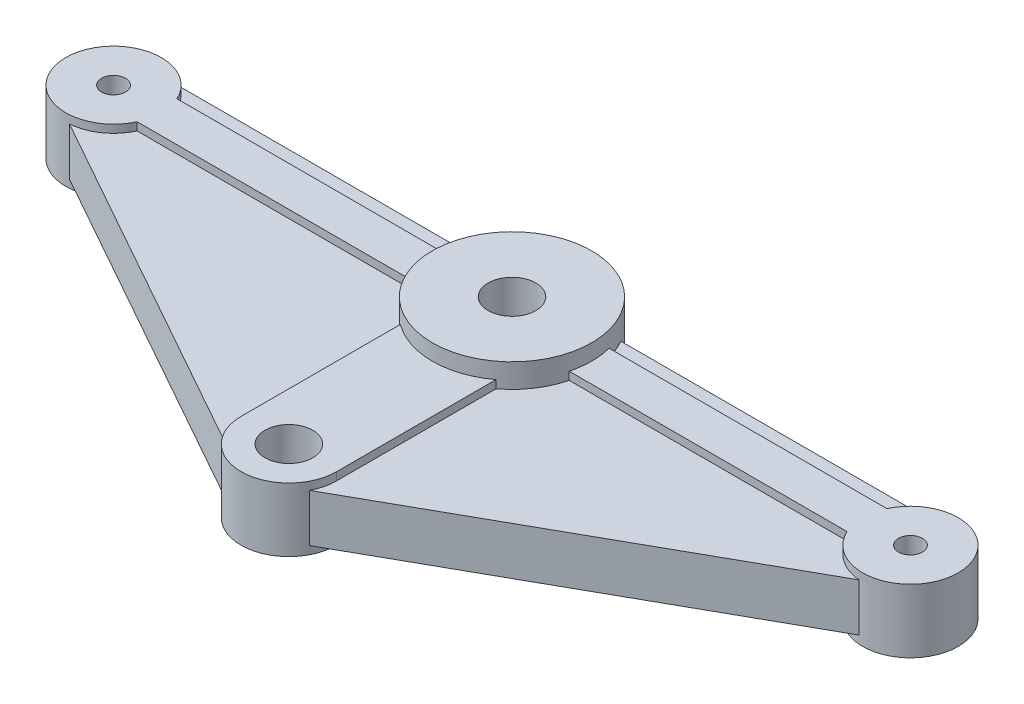
ISO-10303-21;
HEADER;
FILE_DESCRIPTION(('STEP AP214'),'2;1');
FILE_NAME('part.step','',(''),(''),'','','');
FILE_SCHEMA(('AUTOMOTIVE_DESIGN { 1 0 10303 214 1 1 1 1 }'));
ENDSEC;
DATA;
#1=APPLICATION_CONTEXT('core data for automotive mechanical design processes');
#2=APPLICATION_PROTOCOL_DEFINITION('international standard','automotive_design',2000,#1);
#3=PRODUCT_CONTEXT('',#1,'mechanical');
#4=PRODUCT('Part','Part','',(#3));
#5=PRODUCT_RELATED_PRODUCT_CATEGORY('part','',(#4));
#6=PRODUCT_DEFINITION_FORMATION('','',#4);
#7=PRODUCT_DEFINITION_CONTEXT('part definition',#1,'design');
#8=PRODUCT_DEFINITION('design','',#6,#7);
#9=PRODUCT_DEFINITION_SHAPE('','',#8);
#10=(LENGTH_UNIT() NAMED_UNIT(*) SI_UNIT(.MILLI.,.METRE.));
#11=(NAMED_UNIT(*) PLANE_ANGLE_UNIT() SI_UNIT($,.RADIAN.));
#12=(NAMED_UNIT(*) SI_UNIT($,.STERADIAN.) SOLID_ANGLE_UNIT());
#13=UNCERTAINTY_MEASURE_WITH_UNIT(LENGTH_MEASURE(1.E-05),#10,'distance_accuracy_value','');
#14=(GEOMETRIC_REPRESENTATION_CONTEXT(3) GLOBAL_UNCERTAINTY_ASSIGNED_CONTEXT((#13)) GLOBAL_UNIT_ASSIGNED_CONTEXT((#10,
#11,#12)) REPRESENTATION_CONTEXT('',''));
#15=CARTESIAN_POINT('',(0.,0.,0.));
#16=DIRECTION('',(0.,0.,1.));
#17=DIRECTION('',(1.,0.,0.));
#18=AXIS2_PLACEMENT_3D('',#15,#16,#17);
#19=CARTESIAN_POINT('',(-25.,1.5,0.));
#20=DIRECTION('',(0.,1.,0.));
#21=DIRECTION('',(0.,0.,1.));
#22=AXIS2_PLACEMENT_3D('',#19,#20,#21);
#23=PLANE('',#22);
#24=DIRECTION('',(1.,0.,0.));
#25=VECTOR('',#24,1.);
#26=CARTESIAN_POINT('',(-25.,1.5,-1.25));
#27=LINE('',#26,#25);
#28=CARTESIAN_POINT('',(-22.2728219713411,1.5,-1.25));
#29=VERTEX_POINT('',#28);
#30=CARTESIAN_POINT('',(-4.84122918275927,1.5,-1.25));
#31=VERTEX_POINT('',#30);
#32=EDGE_CURVE('E333',#29,#31,#27,.T.);
#33=ORIENTED_EDGE('',*,*,#32,.T.);
#34=CARTESIAN_POINT('',(0.,1.5,0.));
#35=DIRECTION('',(0.,1.,0.));
#36=DIRECTION('',(0.,0.,1.));
#37=AXIS2_PLACEMENT_3D('',#34,#35,#36);
#38=CIRCLE('',#37,5.);
#39=CARTESIAN_POINT('',(-4.33012701892219,1.5,-2.50000000000001));
#40=VERTEX_POINT('',#39);
#41=EDGE_CURVE('E491',#31,#40,#38,.F.);
#42=ORIENTED_EDGE('',*,*,#41,.T.);
#43=DIRECTION('',(-1.,0.,0.));
#44=VECTOR('',#43,1.);
#45=CARTESIAN_POINT('',(-25.,1.5,-2.50000000000001));
#46=LINE('',#45,#44);
#47=CARTESIAN_POINT('',(-23.3416876048223,1.5,-2.50000000000001));
#48=VERTEX_POINT('',#47);
#49=EDGE_CURVE('E274',#40,#48,#46,.T.);
#50=ORIENTED_EDGE('',*,*,#49,.T.);
#51=CARTESIAN_POINT('',(-25.,1.5,0.));
#52=DIRECTION('',(0.,1.,0.));
#53=DIRECTION('',(0.,0.,1.));
#54=AXIS2_PLACEMENT_3D('',#51,#52,#53);
#55=CIRCLE('',#54,3.);
#56=EDGE_CURVE('E352',#48,#29,#55,.F.);
#57=ORIENTED_EDGE('',*,*,#56,.T.);
#58=EDGE_LOOP('',(#33,#42,#50,#57));
#59=FACE_BOUND('',#58,.T.);
#60=ADVANCED_FACE('F30',(#59),#23,.T.);
#61=CARTESIAN_POINT('',(23.3416876048223,1.5,-2.50000000000001));
#62=VERTEX_POINT('',#61);
#63=CARTESIAN_POINT('',(4.33012701892219,1.5,-2.50000000000001));
#64=VERTEX_POINT('',#63);
#65=EDGE_CURVE('E275',#62,#64,#46,.T.);
#66=ORIENTED_EDGE('',*,*,#65,.T.);
#67=CARTESIAN_POINT('',(4.84122918275927,1.5,-1.25));
#68=VERTEX_POINT('',#67);
#69=EDGE_CURVE('E477',#64,#68,#38,.F.);
#70=ORIENTED_EDGE('',*,*,#69,.T.);
#71=DIRECTION('',(1.,0.,0.));
#72=VECTOR('',#71,1.);
#73=CARTESIAN_POINT('',(-25.,1.5,-1.25));
#74=LINE('',#73,#72);
#75=CARTESIAN_POINT('',(22.2728219713411,1.5,-1.25));
#76=VERTEX_POINT('',#75);
#77=EDGE_CURVE('E338',#68,#76,#74,.T.);
#78=ORIENTED_EDGE('',*,*,#77,.T.);
#79=CARTESIAN_POINT('',(25.,1.5,0.));
#80=DIRECTION('',(0.,1.,0.));
#81=DIRECTION('',(0.,0.,1.));
#82=AXIS2_PLACEMENT_3D('',#79,#80,#81);
#83=CIRCLE('',#82,3.);
#84=EDGE_CURVE('E343',#76,#62,#83,.F.);
#85=ORIENTED_EDGE('',*,*,#84,.T.);
#86=EDGE_LOOP('',(#66,#70,#78,#85));
#87=FACE_BOUND('',#86,.T.);
#88=ADVANCED_FACE('F529',(#87),#23,.T.);
#89=CARTESIAN_POINT('',(-25.,-1.5,0.));
#90=DIRECTION('',(0.,1.,0.));
#91=DIRECTION('',(0.,0.,1.));
#92=AXIS2_PLACEMENT_3D('',#89,#90,#91);
#93=PLANE('',#92);
#94=CARTESIAN_POINT('',(0.,-1.5,0.));
#95=DIRECTION('',(0.,1.,0.));
#96=DIRECTION('',(0.,0.,1.));
#97=AXIS2_PLACEMENT_3D('',#94,#95,#96);
#98=CIRCLE('',#97,5.);
#99=CARTESIAN_POINT('',(-4.84122918275927,-1.5,-1.25));
#100=VERTEX_POINT('',#99);
#101=CARTESIAN_POINT('',(-4.33012701892219,-1.5,-2.50000000000001));
#102=VERTEX_POINT('',#101);
#103=EDGE_CURVE('E482',#100,#102,#98,.F.);
#104=ORIENTED_EDGE('',*,*,#103,.F.);
#105=DIRECTION('',(1.,0.,0.));
#106=VECTOR('',#105,1.);
#107=CARTESIAN_POINT('',(-25.,-1.5,-1.25));
#108=LINE('',#107,#106);
#109=CARTESIAN_POINT('',(-22.2728219713411,-1.5,-1.25));
#110=VERTEX_POINT('',#109);
#111=EDGE_CURVE('E326',#110,#100,#108,.T.);
#112=ORIENTED_EDGE('',*,*,#111,.F.);
#113=CARTESIAN_POINT('',(-25.,-1.5,0.));
#114=DIRECTION('',(0.,1.,0.));
#115=DIRECTION('',(0.,0.,1.));
#116=AXIS2_PLACEMENT_3D('',#113,#114,#115);
#117=CIRCLE('',#116,3.);
#118=CARTESIAN_POINT('',(-23.3416876048223,-1.5,-2.50000000000001));
#119=VERTEX_POINT('',#118);
#120=EDGE_CURVE('E316',#119,#110,#117,.F.);
#121=ORIENTED_EDGE('',*,*,#120,.F.);
#122=DIRECTION('',(-1.,0.,0.));
#123=VECTOR('',#122,1.);
#124=CARTESIAN_POINT('',(-25.,-1.5,-2.50000000000001));
#125=LINE('',#124,#123);
#126=EDGE_CURVE('E265',#102,#119,#125,.T.);
#127=ORIENTED_EDGE('',*,*,#126,.F.);
#128=EDGE_LOOP('',(#104,#112,#121,#127));
#129=FACE_BOUND('',#128,.T.);
#130=ADVANCED_FACE('F535',(#129),#93,.F.);
#131=CARTESIAN_POINT('',(4.33012701892219,-1.5,-2.50000000000001));
#132=VERTEX_POINT('',#131);
#133=CARTESIAN_POINT('',(4.84122918275927,-1.5,-1.25));
#134=VERTEX_POINT('',#133);
#135=EDGE_CURVE('E471',#132,#134,#98,.F.);
#136=ORIENTED_EDGE('',*,*,#135,.F.);
#137=CARTESIAN_POINT('',(23.3416876048223,-1.5,-2.50000000000001));
#138=VERTEX_POINT('',#137);
#139=EDGE_CURVE('E266',#138,#132,#125,.T.);
#140=ORIENTED_EDGE('',*,*,#139,.F.);
#141=CARTESIAN_POINT('',(25.,-1.5,0.));
#142=DIRECTION('',(0.,1.,0.));
#143=DIRECTION('',(0.,0.,1.));
#144=AXIS2_PLACEMENT_3D('',#141,#142,#143);
#145=CIRCLE('',#144,3.);
#146=CARTESIAN_POINT('',(22.2728219713411,-1.5,-1.25));
#147=VERTEX_POINT('',#146);
#148=EDGE_CURVE('E340',#147,#138,#145,.F.);
#149=ORIENTED_EDGE('',*,*,#148,.F.);
#150=DIRECTION('',(1.,0.,0.));
#151=VECTOR('',#150,1.);
#152=CARTESIAN_POINT('',(-25.,-1.5,-1.25));
#153=LINE('',#152,#151);
#154=EDGE_CURVE('E336',#134,#147,#153,.T.);
#155=ORIENTED_EDGE('',*,*,#154,.F.);
#156=EDGE_LOOP('',(#136,#140,#149,#155));
#157=FACE_BOUND('',#156,.T.);
#158=ADVANCED_FACE('F552',(#157),#93,.F.);
#159=CARTESIAN_POINT('',(-25.,1.5,-2.50000000000001));
#160=DIRECTION('',(0.,0.,1.));
#161=DIRECTION('',(1.,0.,0.));
#162=AXIS2_PLACEMENT_3D('',#159,#160,#161);
#163=PLANE('',#162);
#164=DIRECTION('',(0.,-1.,0.));
#165=VECTOR('',#164,1.);
#166=CARTESIAN_POINT('',(-4.33012701892219,3.,-2.50000000000001));
#167=LINE('',#166,#165);
#168=EDGE_CURVE('E484',#102,#40,#167,.F.);
#169=ORIENTED_EDGE('',*,*,#168,.F.);
#170=ORIENTED_EDGE('',*,*,#126,.T.);
#171=DIRECTION('',(0.,-1.,0.));
#172=VECTOR('',#171,1.);
#173=CARTESIAN_POINT('',(-23.3416876048223,2.,-2.50000000000001));
#174=LINE('',#173,#172);
#175=EDGE_CURVE('E281',#48,#119,#174,.T.);
#176=ORIENTED_EDGE('',*,*,#175,.F.);
#177=ORIENTED_EDGE('',*,*,#49,.F.);
#178=EDGE_LOOP('',(#169,#170,#176,#177));
#179=FACE_BOUND('',#178,.T.);
#180=ADVANCED_FACE('F563',(#179),#163,.F.);
#181=DIRECTION('',(0.,-1.,0.));
#182=VECTOR('',#181,1.);
#183=CARTESIAN_POINT('',(4.33012701892219,3.,-2.50000000000001));
#184=LINE('',#183,#182);
#185=EDGE_CURVE('E472',#64,#132,#184,.T.);
#186=ORIENTED_EDGE('',*,*,#185,.F.);
#187=ORIENTED_EDGE('',*,*,#65,.F.);
#188=DIRECTION('',(0.,-1.,0.));
#189=VECTOR('',#188,1.);
#190=CARTESIAN_POINT('',(23.3416876048223,2.,-2.50000000000001));
#191=LINE('',#190,#189);
#192=EDGE_CURVE('E278',#138,#62,#191,.F.);
#193=ORIENTED_EDGE('',*,*,#192,.F.);
#194=ORIENTED_EDGE('',*,*,#139,.T.);
#195=EDGE_LOOP('',(#186,#187,#193,#194));
#196=FACE_BOUND('',#195,.T.);
#197=ADVANCED_FACE('F569',(#196),#163,.F.);
#198=CARTESIAN_POINT('',(-22.2728219713411,2.,1.25));
#199=DIRECTION('',(0.,0.,-1.));
#200=DIRECTION('',(-1.,0.,0.));
#201=AXIS2_PLACEMENT_3D('',#198,#199,#200);
#202=PLANE('',#201);
#203=DIRECTION('',(0.,-1.,0.));
#204=VECTOR('',#203,1.);
#205=CARTESIAN_POINT('',(-4.84122918275927,3.,1.25));
#206=LINE('',#205,#204);
#207=CARTESIAN_POINT('',(-4.84122918275927,-1.5,1.25));
#208=VERTEX_POINT('',#207);
#209=CARTESIAN_POINT('',(-4.84122918275927,-2.,1.25));
#210=VERTEX_POINT('',#209);
#211=EDGE_CURVE('E303',#208,#210,#206,.T.);
#212=ORIENTED_EDGE('',*,*,#211,.F.);
#213=DIRECTION('',(-1.,0.,0.));
#214=VECTOR('',#213,1.);
#215=CARTESIAN_POINT('',(-25.,-1.5,1.25));
#216=LINE('',#215,#214);
#217=CARTESIAN_POINT('',(-22.2728219713411,-1.5,1.25));
#218=VERTEX_POINT('',#217);
#219=EDGE_CURVE('E38',#208,#218,#216,.T.);
#220=ORIENTED_EDGE('',*,*,#219,.T.);
#221=DIRECTION('',(0.,-1.,0.));
#222=VECTOR('',#221,1.);
#223=CARTESIAN_POINT('',(-22.2728219713411,2.,1.25));
#224=LINE('',#223,#222);
#225=CARTESIAN_POINT('',(-22.2728219713411,-2.,1.25));
#226=VERTEX_POINT('',#225);
#227=EDGE_CURVE('E301',#218,#226,#224,.T.);
#228=ORIENTED_EDGE('',*,*,#227,.T.);
#229=DIRECTION('',(1.,0.,0.));
#230=VECTOR('',#229,1.);
#231=CARTESIAN_POINT('',(-22.2728219713411,-2.,1.25));
#232=LINE('',#231,#230);
#233=EDGE_CURVE('E436',#226,#210,#232,.T.);
#234=ORIENTED_EDGE('',*,*,#233,.T.);
#235=EDGE_LOOP('',(#212,#220,#228,#234));
#236=FACE_BOUND('',#235,.T.);
#237=ADVANCED_FACE('F298',(#236),#202,.F.);
#238=CARTESIAN_POINT('',(-3.,2.,1.25));
#239=DIRECTION('',(1.,0.,0.));
#240=DIRECTION('',(0.,0.,-1.));
#241=AXIS2_PLACEMENT_3D('',#238,#239,#240);
#242=PLANE('',#241);
#243=DIRECTION('',(0.,-1.,0.));
#244=VECTOR('',#243,1.);
#245=CARTESIAN_POINT('',(-3.,3.,4.));
#246=LINE('',#245,#244);
#247=CARTESIAN_POINT('',(-3.,-2.,4.));
#248=VERTEX_POINT('',#247);
#249=CARTESIAN_POINT('',(-3.,-1.5,4.));
#250=VERTEX_POINT('',#249);
#251=EDGE_CURVE('E464',#248,#250,#246,.F.);
#252=ORIENTED_EDGE('',*,*,#251,.F.);
#253=DIRECTION('',(0.,0.,1.));
#254=VECTOR('',#253,1.);
#255=CARTESIAN_POINT('',(-3.,-2.,1.25));
#256=LINE('',#255,#254);
#257=CARTESIAN_POINT('',(-3.,-2.,14.));
#258=VERTEX_POINT('',#257);
#259=EDGE_CURVE('E378',#248,#258,#256,.T.);
#260=ORIENTED_EDGE('',*,*,#259,.T.);
#261=DIRECTION('',(0.,-1.,0.));
#262=VECTOR('',#261,1.);
#263=CARTESIAN_POINT('',(-3.,2.,14.));
#264=LINE('',#263,#262);
#265=CARTESIAN_POINT('',(-3.,-1.5,14.));
#266=VERTEX_POINT('',#265);
#267=EDGE_CURVE('E327',#266,#258,#264,.T.);
#268=ORIENTED_EDGE('',*,*,#267,.F.);
#269=DIRECTION('',(0.,0.,-1.));
#270=VECTOR('',#269,1.);
#271=CARTESIAN_POINT('',(-3.,-1.5,0.));
#272=LINE('',#271,#270);
#273=EDGE_CURVE('E292',#266,#250,#272,.T.);
#274=ORIENTED_EDGE('',*,*,#273,.T.);
#275=EDGE_LOOP('',(#252,#260,#268,#274));
#276=FACE_BOUND('',#275,.T.);
#277=ADVANCED_FACE('F376',(#276),#242,.F.);
#278=CARTESIAN_POINT('',(3.,2.,1.25));
#279=DIRECTION('',(-1.,0.,0.));
#280=DIRECTION('',(0.,0.,1.));
#281=AXIS2_PLACEMENT_3D('',#278,#279,#280);
#282=PLANE('',#281);
#283=DIRECTION('',(0.,-1.,0.));
#284=VECTOR('',#283,1.);
#285=CARTESIAN_POINT('',(3.,3.,4.));
#286=LINE('',#285,#284);
#287=CARTESIAN_POINT('',(3.,-1.5,4.));
#288=VERTEX_POINT('',#287);
#289=CARTESIAN_POINT('',(3.,-2.,4.));
#290=VERTEX_POINT('',#289);
#291=EDGE_CURVE('E459',#288,#290,#286,.T.);
#292=ORIENTED_EDGE('',*,*,#291,.F.);
#293=DIRECTION('',(0.,0.,1.));
#294=VECTOR('',#293,1.);
#295=CARTESIAN_POINT('',(3.,-1.5,0.));
#296=LINE('',#295,#294);
#297=CARTESIAN_POINT('',(3.,-1.5,14.));
#298=VERTEX_POINT('',#297);
#299=EDGE_CURVE('E290',#288,#298,#296,.T.);
#300=ORIENTED_EDGE('',*,*,#299,.T.);
#301=DIRECTION('',(0.,-1.,0.));
#302=VECTOR('',#301,1.);
#303=CARTESIAN_POINT('',(3.,2.,14.));
#304=LINE('',#303,#302);
#305=CARTESIAN_POINT('',(3.,-2.,14.));
#306=VERTEX_POINT('',#305);
#307=EDGE_CURVE('E381',#298,#306,#304,.T.);
#308=ORIENTED_EDGE('',*,*,#307,.T.);
#309=DIRECTION('',(0.,0.,-1.));
#310=VECTOR('',#309,1.);
#311=CARTESIAN_POINT('',(3.,-2.,1.25));
#312=LINE('',#311,#310);
#313=EDGE_CURVE('E430',#306,#290,#312,.T.);
#314=ORIENTED_EDGE('',*,*,#313,.T.);
#315=EDGE_LOOP('',(#292,#300,#308,#314));
#316=FACE_BOUND('',#315,.T.);
#317=ADVANCED_FACE('F603',(#316),#282,.F.);
#318=CARTESIAN_POINT('',(3.,2.,1.25));
#319=DIRECTION('',(0.,0.,-1.));
#320=DIRECTION('',(-1.,0.,0.));
#321=AXIS2_PLACEMENT_3D('',#318,#319,#320);
#322=PLANE('',#321);
#323=DIRECTION('',(0.,-1.,0.));
#324=VECTOR('',#323,1.);
#325=CARTESIAN_POINT('',(4.84122918275927,3.,1.25));
#326=LINE('',#325,#324);
#327=CARTESIAN_POINT('',(4.84122918275927,-2.,1.25));
#328=VERTEX_POINT('',#327);
#329=CARTESIAN_POINT('',(4.84122918275927,-1.5,1.25));
#330=VERTEX_POINT('',#329);
#331=EDGE_CURVE('E461',#328,#330,#326,.F.);
#332=ORIENTED_EDGE('',*,*,#331,.F.);
#333=DIRECTION('',(1.,0.,0.));
#334=VECTOR('',#333,1.);
#335=CARTESIAN_POINT('',(3.,-2.,1.25));
#336=LINE('',#335,#334);
#337=CARTESIAN_POINT('',(22.2728219713411,-2.,1.25));
#338=VERTEX_POINT('',#337);
#339=EDGE_CURVE('E428',#328,#338,#336,.T.);
#340=ORIENTED_EDGE('',*,*,#339,.T.);
#341=DIRECTION('',(0.,-1.,0.));
#342=VECTOR('',#341,1.);
#343=CARTESIAN_POINT('',(22.2728219713411,2.,1.25));
#344=LINE('',#343,#342);
#345=CARTESIAN_POINT('',(22.2728219713411,-1.5,1.25));
#346=VERTEX_POINT('',#345);
#347=EDGE_CURVE('E390',#346,#338,#344,.T.);
#348=ORIENTED_EDGE('',*,*,#347,.F.);
#349=DIRECTION('',(-1.,0.,0.));
#350=VECTOR('',#349,1.);
#351=CARTESIAN_POINT('',(-25.,-1.5,1.25));
#352=LINE('',#351,#350);
#353=EDGE_CURVE('E287',#346,#330,#352,.T.);
#354=ORIENTED_EDGE('',*,*,#353,.T.);
#355=EDGE_LOOP('',(#332,#340,#348,#354));
#356=FACE_BOUND('',#355,.T.);
#357=ADVANCED_FACE('F666',(#356),#322,.F.);
#358=CARTESIAN_POINT('',(0.829156197588851,2.,-1.25));
#359=DIRECTION('',(0.,0.,1.));
#360=DIRECTION('',(1.,0.,0.));
#361=AXIS2_PLACEMENT_3D('',#358,#359,#360);
#362=PLANE('',#361);
#363=DIRECTION('',(0.,-1.,0.));
#364=VECTOR('',#363,1.);
#365=CARTESIAN_POINT('',(4.84122918275927,3.,-1.25));
#366=LINE('',#365,#364);
#367=CARTESIAN_POINT('',(4.84122918275927,-2.,-1.25));
#368=VERTEX_POINT('',#367);
#369=EDGE_CURVE('E467',#134,#368,#366,.T.);
#370=ORIENTED_EDGE('',*,*,#369,.F.);
#371=ORIENTED_EDGE('',*,*,#154,.T.);
#372=DIRECTION('',(0.,-1.,0.));
#373=VECTOR('',#372,1.);
#374=CARTESIAN_POINT('',(22.2728219713411,2.,-1.25));
#375=LINE('',#374,#373);
#376=CARTESIAN_POINT('',(22.2728219713411,-2.,-1.25));
#377=VERTEX_POINT('',#376);
#378=EDGE_CURVE('E394',#147,#377,#375,.T.);
#379=ORIENTED_EDGE('',*,*,#378,.T.);
#380=DIRECTION('',(-1.,0.,0.));
#381=VECTOR('',#380,1.);
#382=CARTESIAN_POINT('',(0.829156197588851,-2.,-1.25));
#383=LINE('',#382,#381);
#384=EDGE_CURVE('E422',#377,#368,#383,.T.);
#385=ORIENTED_EDGE('',*,*,#384,.T.);
#386=EDGE_LOOP('',(#370,#371,#379,#385));
#387=FACE_BOUND('',#386,.T.);
#388=ADVANCED_FACE('F589',(#387),#362,.F.);
#389=CARTESIAN_POINT('',(-22.2728219713411,2.,-1.25));
#390=DIRECTION('',(0.,0.,1.));
#391=DIRECTION('',(1.,0.,0.));
#392=AXIS2_PLACEMENT_3D('',#389,#390,#391);
#393=PLANE('',#392);
#394=DIRECTION('',(0.,-1.,0.));
#395=VECTOR('',#394,1.);
#396=CARTESIAN_POINT('',(-4.84122918275927,3.,-1.25));
#397=LINE('',#396,#395);
#398=CARTESIAN_POINT('',(-4.84122918275927,-2.,-1.25));
#399=VERTEX_POINT('',#398);
#400=EDGE_CURVE('E478',#399,#100,#397,.F.);
#401=ORIENTED_EDGE('',*,*,#400,.F.);
#402=DIRECTION('',(-1.,0.,0.));
#403=VECTOR('',#402,1.);
#404=CARTESIAN_POINT('',(-22.2728219713411,-2.,-1.25));
#405=LINE('',#404,#403);
#406=CARTESIAN_POINT('',(-22.2728219713411,-2.,-1.25));
#407=VERTEX_POINT('',#406);
#408=EDGE_CURVE('E420',#399,#407,#405,.T.);
#409=ORIENTED_EDGE('',*,*,#408,.T.);
#410=DIRECTION('',(0.,-1.,0.));
#411=VECTOR('',#410,1.);
#412=CARTESIAN_POINT('',(-22.2728219713411,2.,-1.25));
#413=LINE('',#412,#411);
#414=EDGE_CURVE('E398',#110,#407,#413,.T.);
#415=ORIENTED_EDGE('',*,*,#414,.F.);
#416=ORIENTED_EDGE('',*,*,#111,.T.);
#417=EDGE_LOOP('',(#401,#409,#415,#416));
#418=FACE_BOUND('',#417,.T.);
#419=ADVANCED_FACE('F559',(#418),#393,.F.);
#420=CARTESIAN_POINT('',(-25.,2.,0.));
#421=DIRECTION('',(0.,1.,0.));
#422=DIRECTION('',(0.,0.,1.));
#423=AXIS2_PLACEMENT_3D('',#420,#421,#422);
#424=PLANE('',#423);
#425=CARTESIAN_POINT('',(-25.,2.,0.));
#426=DIRECTION('',(0.,1.,0.));
#427=DIRECTION('',(0.,0.,1.));
#428=AXIS2_PLACEMENT_3D('',#425,#426,#427);
#429=CIRCLE('',#428,0.750000000000002);
#430=CARTESIAN_POINT('',(-25.,2.,0.750000000000002));
#431=VERTEX_POINT('',#430);
#432=EDGE_CURVE('E451',#431,#431,#429,.T.);
#433=ORIENTED_EDGE('',*,*,#432,.F.);
#434=EDGE_LOOP('',(#433));
#435=FACE_BOUND('',#434,.T.);
#436=DIRECTION('',(1.,0.,0.));
#437=VECTOR('',#436,1.);
#438=CARTESIAN_POINT('',(-22.2728219713411,2.,1.25));
#439=LINE('',#438,#437);
#440=CARTESIAN_POINT('',(-22.2728219713411,2.,1.25));
#441=VERTEX_POINT('',#440);
#442=CARTESIAN_POINT('',(-4.84122918275927,2.,1.25));
#443=VERTEX_POINT('',#442);
#444=EDGE_CURVE('E414',#441,#443,#439,.T.);
#445=ORIENTED_EDGE('',*,*,#444,.T.);
#446=CARTESIAN_POINT('',(0.,2.,0.));
#447=DIRECTION('',(0.,1.,0.));
#448=DIRECTION('',(0.,0.,1.));
#449=AXIS2_PLACEMENT_3D('',#446,#447,#448);
#450=CIRCLE('',#449,5.);
#451=CARTESIAN_POINT('',(-4.84122918275927,2.,-1.25));
#452=VERTEX_POINT('',#451);
#453=EDGE_CURVE('E498',#443,#452,#450,.F.);
#454=ORIENTED_EDGE('',*,*,#453,.T.);
#455=DIRECTION('',(-1.,0.,0.));
#456=VECTOR('',#455,1.);
#457=CARTESIAN_POINT('',(-22.2728219713411,2.,-1.25));
#458=LINE('',#457,#456);
#459=CARTESIAN_POINT('',(-22.2728219713411,2.,-1.25));
#460=VERTEX_POINT('',#459);
#461=EDGE_CURVE('E399',#452,#460,#458,.T.);
#462=ORIENTED_EDGE('',*,*,#461,.T.);
#463=CARTESIAN_POINT('',(-25.,2.,0.));
#464=DIRECTION('',(0.,1.,0.));
#465=DIRECTION('',(0.,0.,1.));
#466=AXIS2_PLACEMENT_3D('',#463,#464,#465);
#467=CIRCLE('',#466,3.);
#468=EDGE_CURVE('E417',#460,#441,#467,.T.);
#469=ORIENTED_EDGE('',*,*,#468,.T.);
#470=EDGE_LOOP('',(#445,#454,#462,#469));
#471=FACE_BOUND('',#470,.T.);
#472=ADVANCED_FACE('F622',(#435,#471),#424,.T.);
#473=CARTESIAN_POINT('',(25.,2.,0.));
#474=DIRECTION('',(0.,1.,0.));
#475=DIRECTION('',(0.,0.,1.));
#476=AXIS2_PLACEMENT_3D('',#473,#474,#475);
#477=CIRCLE('',#476,0.750000000000002);
#478=CARTESIAN_POINT('',(25.,2.,0.749999999999996));
#479=VERTEX_POINT('',#478);
#480=EDGE_CURVE('E439',#479,#479,#477,.T.);
#481=ORIENTED_EDGE('',*,*,#480,.F.);
#482=EDGE_LOOP('',(#481));
#483=FACE_BOUND('',#482,.T.);
#484=DIRECTION('',(-1.,0.,0.));
#485=VECTOR('',#484,1.);
#486=CARTESIAN_POINT('',(0.829156197588851,2.,-1.25));
#487=LINE('',#486,#485);
#488=CARTESIAN_POINT('',(22.2728219713411,2.,-1.25));
#489=VERTEX_POINT('',#488);
#490=CARTESIAN_POINT('',(4.84122918275927,2.,-1.25));
#491=VERTEX_POINT('',#490);
#492=EDGE_CURVE('E401',#489,#491,#487,.T.);
#493=ORIENTED_EDGE('',*,*,#492,.T.);
#494=CARTESIAN_POINT('',(4.84122918275927,2.,1.25));
#495=VERTEX_POINT('',#494);
#496=EDGE_CURVE('E486',#491,#495,#450,.F.);
#497=ORIENTED_EDGE('',*,*,#496,.T.);
#498=DIRECTION('',(1.,0.,0.));
#499=VECTOR('',#498,1.);
#500=CARTESIAN_POINT('',(3.,2.,1.25));
#501=LINE('',#500,#499);
#502=CARTESIAN_POINT('',(22.2728219713411,2.,1.25));
#503=VERTEX_POINT('',#502);
#504=EDGE_CURVE('E406',#495,#503,#501,.T.);
#505=ORIENTED_EDGE('',*,*,#504,.T.);
#506=CARTESIAN_POINT('',(25.,2.,0.));
#507=DIRECTION('',(0.,1.,0.));
#508=DIRECTION('',(0.,0.,1.));
#509=AXIS2_PLACEMENT_3D('',#506,#507,#508);
#510=CIRCLE('',#509,3.);
#511=EDGE_CURVE('E404',#503,#489,#510,.T.);
#512=ORIENTED_EDGE('',*,*,#511,.T.);
#513=EDGE_LOOP('',(#493,#497,#505,#512));
#514=FACE_BOUND('',#513,.T.);
#515=ADVANCED_FACE('F619',(#483,#514),#424,.T.);
#516=CARTESIAN_POINT('',(0.,2.,14.));
#517=DIRECTION('',(0.,1.,0.));
#518=DIRECTION('',(0.,0.,1.));
#519=AXIS2_PLACEMENT_3D('',#516,#517,#518);
#520=CIRCLE('',#519,1.5);
#521=CARTESIAN_POINT('',(0.,2.,15.5));
#522=VERTEX_POINT('',#521);
#523=EDGE_CURVE('E445',#522,#522,#520,.T.);
#524=ORIENTED_EDGE('',*,*,#523,.F.);
#525=EDGE_LOOP('',(#524));
#526=FACE_BOUND('',#525,.T.);
#527=DIRECTION('',(0.,0.,-1.));
#528=VECTOR('',#527,1.);
#529=CARTESIAN_POINT('',(3.,2.,1.25));
#530=LINE('',#529,#528);
#531=CARTESIAN_POINT('',(3.,2.,14.));
#532=VERTEX_POINT('',#531);
#533=CARTESIAN_POINT('',(3.,2.,4.));
#534=VERTEX_POINT('',#533);
#535=EDGE_CURVE('E408',#532,#534,#530,.T.);
#536=ORIENTED_EDGE('',*,*,#535,.T.);
#537=CARTESIAN_POINT('',(-3.,2.,4.));
#538=VERTEX_POINT('',#537);
#539=EDGE_CURVE('E499',#534,#538,#450,.F.);
#540=ORIENTED_EDGE('',*,*,#539,.T.);
#541=DIRECTION('',(0.,0.,1.));
#542=VECTOR('',#541,1.);
#543=CARTESIAN_POINT('',(-3.,2.,1.25));
#544=LINE('',#543,#542);
#545=CARTESIAN_POINT('',(-3.,2.,14.));
#546=VERTEX_POINT('',#545);
#547=EDGE_CURVE('E247',#538,#546,#544,.T.);
#548=ORIENTED_EDGE('',*,*,#547,.T.);
#549=CARTESIAN_POINT('',(0.,2.,14.));
#550=DIRECTION('',(0.,1.,0.));
#551=DIRECTION('',(0.,0.,1.));
#552=AXIS2_PLACEMENT_3D('',#549,#550,#551);
#553=CIRCLE('',#552,3.);
#554=EDGE_CURVE('E411',#546,#532,#553,.T.);
#555=ORIENTED_EDGE('',*,*,#554,.T.);
#556=EDGE_LOOP('',(#536,#540,#548,#555));
#557=FACE_BOUND('',#556,.T.);
#558=ADVANCED_FACE('F616',(#526,#557),#424,.T.);
#559=CARTESIAN_POINT('',(-25.,-2.,0.));
#560=DIRECTION('',(0.,1.,0.));
#561=DIRECTION('',(0.,0.,1.));
#562=AXIS2_PLACEMENT_3D('',#559,#560,#561);
#563=PLANE('',#562);
#564=CARTESIAN_POINT('',(-25.,-2.,0.));
#565=DIRECTION('',(0.,1.,0.));
#566=DIRECTION('',(0.,0.,1.));
#567=AXIS2_PLACEMENT_3D('',#564,#565,#566);
#568=CIRCLE('',#567,0.750000000000002);
#569=CARTESIAN_POINT('',(-25.,-2.,0.750000000000002));
#570=VERTEX_POINT('',#569);
#571=EDGE_CURVE('E454',#570,#570,#568,.T.);
#572=ORIENTED_EDGE('',*,*,#571,.T.);
#573=EDGE_LOOP('',(#572));
#574=FACE_BOUND('',#573,.T.);
#575=CARTESIAN_POINT('',(0.,-2.,0.));
#576=DIRECTION('',(0.,1.,0.));
#577=DIRECTION('',(0.,0.,1.));
#578=AXIS2_PLACEMENT_3D('',#575,#576,#577);
#579=CIRCLE('',#578,5.);
#580=EDGE_CURVE('E475',#210,#399,#579,.F.);
#581=ORIENTED_EDGE('',*,*,#580,.F.);
#582=ORIENTED_EDGE('',*,*,#233,.F.);
#583=CARTESIAN_POINT('',(-25.,-2.,0.));
#584=DIRECTION('',(0.,1.,0.));
#585=DIRECTION('',(0.,0.,1.));
#586=AXIS2_PLACEMENT_3D('',#583,#584,#585);
#587=CIRCLE('',#586,3.);
#588=EDGE_CURVE('E321',#407,#226,#587,.T.);
#589=ORIENTED_EDGE('',*,*,#588,.F.);
#590=ORIENTED_EDGE('',*,*,#408,.F.);
#591=EDGE_LOOP('',(#581,#582,#589,#590));
#592=FACE_BOUND('',#591,.T.);
#593=ADVANCED_FACE('F618',(#574,#592),#563,.F.);
#594=CARTESIAN_POINT('',(25.,-2.,0.));
#595=DIRECTION('',(0.,1.,0.));
#596=DIRECTION('',(0.,0.,1.));
#597=AXIS2_PLACEMENT_3D('',#594,#595,#596);
#598=CIRCLE('',#597,0.750000000000002);
#599=CARTESIAN_POINT('',(25.,-2.,0.749999999999996));
#600=VERTEX_POINT('',#599);
#601=EDGE_CURVE('E442',#600,#600,#598,.T.);
#602=ORIENTED_EDGE('',*,*,#601,.T.);
#603=EDGE_LOOP('',(#602));
#604=FACE_BOUND('',#603,.T.);
#605=EDGE_CURVE('E463',#368,#328,#579,.F.);
#606=ORIENTED_EDGE('',*,*,#605,.F.);
#607=ORIENTED_EDGE('',*,*,#384,.F.);
#608=CARTESIAN_POINT('',(25.,-2.,0.));
#609=DIRECTION('',(0.,1.,0.));
#610=DIRECTION('',(0.,0.,1.));
#611=AXIS2_PLACEMENT_3D('',#608,#609,#610);
#612=CIRCLE('',#611,3.);
#613=EDGE_CURVE('E425',#338,#377,#612,.T.);
#614=ORIENTED_EDGE('',*,*,#613,.F.);
#615=ORIENTED_EDGE('',*,*,#339,.F.);
#616=EDGE_LOOP('',(#606,#607,#614,#615));
#617=FACE_BOUND('',#616,.T.);
#618=ADVANCED_FACE('F594',(#604,#617),#563,.F.);
#619=CARTESIAN_POINT('',(0.,-2.,14.));
#620=DIRECTION('',(0.,1.,0.));
#621=DIRECTION('',(0.,0.,1.));
#622=AXIS2_PLACEMENT_3D('',#619,#620,#621);
#623=CIRCLE('',#622,1.5);
#624=CARTESIAN_POINT('',(0.,-2.,15.5));
#625=VERTEX_POINT('',#624);
#626=EDGE_CURVE('E448',#625,#625,#623,.T.);
#627=ORIENTED_EDGE('',*,*,#626,.T.);
#628=EDGE_LOOP('',(#627));
#629=FACE_BOUND('',#628,.T.);
#630=EDGE_CURVE('E466',#290,#248,#579,.F.);
#631=ORIENTED_EDGE('',*,*,#630,.F.);
#632=ORIENTED_EDGE('',*,*,#313,.F.);
#633=CARTESIAN_POINT('',(0.,-2.,14.));
#634=DIRECTION('',(0.,1.,0.));
#635=DIRECTION('',(0.,0.,1.));
#636=AXIS2_PLACEMENT_3D('',#633,#634,#635);
#637=CIRCLE('',#636,3.);
#638=EDGE_CURVE('E433',#258,#306,#637,.T.);
#639=ORIENTED_EDGE('',*,*,#638,.F.);
#640=ORIENTED_EDGE('',*,*,#259,.F.);
#641=EDGE_LOOP('',(#631,#632,#639,#640));
#642=FACE_BOUND('',#641,.T.);
#643=ADVANCED_FACE('F599',(#629,#642),#563,.F.);
#644=DIRECTION('',(0.,-1.,0.));
#645=VECTOR('',#644,1.);
#646=CARTESIAN_POINT('',(-4.84122918275927,3.,1.25));
#647=LINE('',#646,#645);
#648=CARTESIAN_POINT('',(-4.84122918275927,1.5,1.25));
#649=VERTEX_POINT('',#648);
#650=EDGE_CURVE('E45',#443,#649,#647,.T.);
#651=ORIENTED_EDGE('',*,*,#650,.F.);
#652=ORIENTED_EDGE('',*,*,#444,.F.);
#653=CARTESIAN_POINT('',(-22.2728219713411,1.5,1.25));
#654=VERTEX_POINT('',#653);
#655=EDGE_CURVE('E322',#441,#654,#224,.T.);
#656=ORIENTED_EDGE('',*,*,#655,.T.);
#657=DIRECTION('',(-1.,0.,0.));
#658=VECTOR('',#657,1.);
#659=CARTESIAN_POINT('',(-25.,1.5,1.25));
#660=LINE('',#659,#658);
#661=EDGE_CURVE('E51',#649,#654,#660,.T.);
#662=ORIENTED_EDGE('',*,*,#661,.F.);
#663=EDGE_LOOP('',(#651,#652,#656,#662));
#664=FACE_BOUND('',#663,.T.);
#665=ADVANCED_FACE('F644',(#664),#202,.F.);
#666=DIRECTION('',(0.,-1.,0.));
#667=VECTOR('',#666,1.);
#668=CARTESIAN_POINT('',(-3.,3.,4.));
#669=LINE('',#668,#667);
#670=CARTESIAN_POINT('',(-3.,1.5,4.));
#671=VERTEX_POINT('',#670);
#672=EDGE_CURVE('E237',#671,#538,#669,.F.);
#673=ORIENTED_EDGE('',*,*,#672,.F.);
#674=DIRECTION('',(0.,0.,-1.));
#675=VECTOR('',#674,1.);
#676=CARTESIAN_POINT('',(-3.,1.5,0.));
#677=LINE('',#676,#675);
#678=CARTESIAN_POINT('',(-3.,1.5,14.));
#679=VERTEX_POINT('',#678);
#680=EDGE_CURVE('E245',#679,#671,#677,.T.);
#681=ORIENTED_EDGE('',*,*,#680,.F.);
#682=EDGE_CURVE('E323',#546,#679,#264,.T.);
#683=ORIENTED_EDGE('',*,*,#682,.F.);
#684=ORIENTED_EDGE('',*,*,#547,.F.);
#685=EDGE_LOOP('',(#673,#681,#683,#684));
#686=FACE_BOUND('',#685,.T.);
#687=ADVANCED_FACE('F243',(#686),#242,.F.);
#688=DIRECTION('',(0.,-1.,0.));
#689=VECTOR('',#688,1.);
#690=CARTESIAN_POINT('',(3.,3.,4.));
#691=LINE('',#690,#689);
#692=CARTESIAN_POINT('',(3.,1.5,4.));
#693=VERTEX_POINT('',#692);
#694=EDGE_CURVE('E494',#534,#693,#691,.T.);
#695=ORIENTED_EDGE('',*,*,#694,.F.);
#696=ORIENTED_EDGE('',*,*,#535,.F.);
#697=CARTESIAN_POINT('',(3.,1.5,14.));
#698=VERTEX_POINT('',#697);
#699=EDGE_CURVE('E379',#532,#698,#304,.T.);
#700=ORIENTED_EDGE('',*,*,#699,.T.);
#701=DIRECTION('',(0.,0.,1.));
#702=VECTOR('',#701,1.);
#703=CARTESIAN_POINT('',(3.,1.5,0.));
#704=LINE('',#703,#702);
#705=EDGE_CURVE('E254',#693,#698,#704,.T.);
#706=ORIENTED_EDGE('',*,*,#705,.F.);
#707=EDGE_LOOP('',(#695,#696,#700,#706));
#708=FACE_BOUND('',#707,.T.);
#709=ADVANCED_FACE('F614',(#708),#282,.F.);
#710=DIRECTION('',(0.,-1.,0.));
#711=VECTOR('',#710,1.);
#712=CARTESIAN_POINT('',(4.84122918275927,3.,1.25));
#713=LINE('',#712,#711);
#714=CARTESIAN_POINT('',(4.84122918275927,1.5,1.25));
#715=VERTEX_POINT('',#714);
#716=EDGE_CURVE('E487',#715,#495,#713,.F.);
#717=ORIENTED_EDGE('',*,*,#716,.F.);
#718=DIRECTION('',(-1.,0.,0.));
#719=VECTOR('',#718,1.);
#720=CARTESIAN_POINT('',(-25.,1.5,1.25));
#721=LINE('',#720,#719);
#722=CARTESIAN_POINT('',(22.2728219713411,1.5,1.25));
#723=VERTEX_POINT('',#722);
#724=EDGE_CURVE('E258',#723,#715,#721,.T.);
#725=ORIENTED_EDGE('',*,*,#724,.F.);
#726=EDGE_CURVE('E386',#503,#723,#344,.T.);
#727=ORIENTED_EDGE('',*,*,#726,.F.);
#728=ORIENTED_EDGE('',*,*,#504,.F.);
#729=EDGE_LOOP('',(#717,#725,#727,#728));
#730=FACE_BOUND('',#729,.T.);
#731=ADVANCED_FACE('F670',(#730),#322,.F.);
#732=DIRECTION('',(0.,-1.,0.));
#733=VECTOR('',#732,1.);
#734=CARTESIAN_POINT('',(4.84122918275927,3.,-1.25));
#735=LINE('',#734,#733);
#736=EDGE_CURVE('E480',#491,#68,#735,.T.);
#737=ORIENTED_EDGE('',*,*,#736,.F.);
#738=ORIENTED_EDGE('',*,*,#492,.F.);
#739=EDGE_CURVE('E391',#489,#76,#375,.T.);
#740=ORIENTED_EDGE('',*,*,#739,.T.);
#741=ORIENTED_EDGE('',*,*,#77,.F.);
#742=EDGE_LOOP('',(#737,#738,#740,#741));
#743=FACE_BOUND('',#742,.T.);
#744=ADVANCED_FACE('F556',(#743),#362,.F.);
#745=DIRECTION('',(0.,-1.,0.));
#746=VECTOR('',#745,1.);
#747=CARTESIAN_POINT('',(-4.84122918275927,3.,-1.25));
#748=LINE('',#747,#746);
#749=EDGE_CURVE('E496',#31,#452,#748,.F.);
#750=ORIENTED_EDGE('',*,*,#749,.F.);
#751=ORIENTED_EDGE('',*,*,#32,.F.);
#752=EDGE_CURVE('E395',#460,#29,#413,.T.);
#753=ORIENTED_EDGE('',*,*,#752,.F.);
#754=ORIENTED_EDGE('',*,*,#461,.F.);
#755=EDGE_LOOP('',(#750,#751,#753,#754));
#756=FACE_BOUND('',#755,.T.);
#757=ADVANCED_FACE('F550',(#756),#393,.F.);
#758=CARTESIAN_POINT('',(0.,-1.5,0.));
#759=DIRECTION('',(0.,1.,0.));
#760=DIRECTION('',(0.,0.,1.));
#761=AXIS2_PLACEMENT_3D('',#758,#759,#760);
#762=CIRCLE('',#761,5.);
#763=EDGE_CURVE('E457',#330,#288,#762,.F.);
#764=ORIENTED_EDGE('',*,*,#763,.F.);
#765=ORIENTED_EDGE('',*,*,#353,.F.);
#766=CARTESIAN_POINT('',(24.7746208812131,-1.5,2.99152206289955));
#767=VERTEX_POINT('',#766);
#768=EDGE_CURVE('E344',#767,#346,#145,.F.);
#769=ORIENTED_EDGE('',*,*,#768,.F.);
#770=DIRECTION('',(0.87250601594972,0.,-0.488603368931843));
#771=VECTOR('',#770,1.);
#772=CARTESIAN_POINT('',(26.2215084223296,-1.5,2.1812650398743));
#773=LINE('',#772,#771);
#774=CARTESIAN_POINT('',(2.66839596344615,-1.5,15.371008016849));
#775=VERTEX_POINT('',#774);
#776=EDGE_CURVE('E263',#775,#767,#773,.T.);
#777=ORIENTED_EDGE('',*,*,#776,.F.);
#778=CARTESIAN_POINT('',(0.,-1.5,14.));
#779=DIRECTION('',(0.,1.,0.));
#780=DIRECTION('',(0.,0.,1.));
#781=AXIS2_PLACEMENT_3D('',#778,#779,#780);
#782=CIRCLE('',#781,3.);
#783=EDGE_CURVE('E355',#298,#775,#782,.F.);
#784=ORIENTED_EDGE('',*,*,#783,.F.);
#785=ORIENTED_EDGE('',*,*,#299,.F.);
#786=EDGE_LOOP('',(#764,#765,#769,#777,#784,#785));
#787=FACE_BOUND('',#786,.T.);
#788=ADVANCED_FACE('F545',(#787),#93,.F.);
#789=ORIENTED_EDGE('',*,*,#724,.T.);
#790=CARTESIAN_POINT('',(0.,1.5,0.));
#791=DIRECTION('',(0.,1.,0.));
#792=DIRECTION('',(0.,0.,1.));
#793=AXIS2_PLACEMENT_3D('',#790,#791,#792);
#794=CIRCLE('',#793,5.);
#795=EDGE_CURVE('E489',#715,#693,#794,.F.);
#796=ORIENTED_EDGE('',*,*,#795,.T.);
#797=ORIENTED_EDGE('',*,*,#705,.T.);
#798=CARTESIAN_POINT('',(0.,1.5,14.));
#799=DIRECTION('',(0.,1.,0.));
#800=DIRECTION('',(0.,0.,1.));
#801=AXIS2_PLACEMENT_3D('',#798,#799,#800);
#802=CIRCLE('',#801,3.);
#803=CARTESIAN_POINT('',(2.66839596344615,1.5,15.371008016849));
#804=VERTEX_POINT('',#803);
#805=EDGE_CURVE('E358',#698,#804,#802,.F.);
#806=ORIENTED_EDGE('',*,*,#805,.T.);
#807=DIRECTION('',(0.87250601594972,0.,-0.488603368931843));
#808=VECTOR('',#807,1.);
#809=CARTESIAN_POINT('',(26.2215084223296,1.5,2.1812650398743));
#810=LINE('',#809,#808);
#811=CARTESIAN_POINT('',(24.7746208812131,1.5,2.99152206289955));
#812=VERTEX_POINT('',#811);
#813=EDGE_CURVE('E271',#804,#812,#810,.T.);
#814=ORIENTED_EDGE('',*,*,#813,.T.);
#815=EDGE_CURVE('E348',#812,#723,#83,.F.);
#816=ORIENTED_EDGE('',*,*,#815,.T.);
#817=EDGE_LOOP('',(#789,#796,#797,#806,#814,#816));
#818=FACE_BOUND('',#817,.T.);
#819=ADVANCED_FACE('F537',(#818),#23,.T.);
#820=CARTESIAN_POINT('',(0.,-1.5,0.));
#821=DIRECTION('',(0.,1.,0.));
#822=DIRECTION('',(0.,0.,1.));
#823=AXIS2_PLACEMENT_3D('',#820,#821,#822);
#824=CIRCLE('',#823,5.);
#825=EDGE_CURVE('E469',#250,#208,#824,.F.);
#826=ORIENTED_EDGE('',*,*,#825,.F.);
#827=ORIENTED_EDGE('',*,*,#273,.F.);
#828=CARTESIAN_POINT('',(-2.66839596344615,-1.5,15.371008016849));
#829=VERTEX_POINT('',#828);
#830=EDGE_CURVE('E359',#829,#266,#782,.F.);
#831=ORIENTED_EDGE('',*,*,#830,.F.);
#832=DIRECTION('',(0.87250601594972,0.,0.488603368931842));
#833=VECTOR('',#832,1.);
#834=CARTESIAN_POINT('',(-26.2215084223296,-1.5,2.18126503987431));
#835=LINE('',#834,#833);
#836=CARTESIAN_POINT('',(-24.7746208812131,-1.5,2.99152206289956));
#837=VERTEX_POINT('',#836);
#838=EDGE_CURVE('E256',#837,#829,#835,.T.);
#839=ORIENTED_EDGE('',*,*,#838,.F.);
#840=EDGE_CURVE('E308',#218,#837,#117,.F.);
#841=ORIENTED_EDGE('',*,*,#840,.F.);
#842=ORIENTED_EDGE('',*,*,#219,.F.);
#843=EDGE_LOOP('',(#826,#827,#831,#839,#841,#842));
#844=FACE_BOUND('',#843,.T.);
#845=ADVANCED_FACE('F309',(#844),#93,.F.);
#846=ORIENTED_EDGE('',*,*,#680,.T.);
#847=CARTESIAN_POINT('',(0.,1.5,0.));
#848=DIRECTION('',(0.,1.,0.));
#849=DIRECTION('',(0.,0.,1.));
#850=AXIS2_PLACEMENT_3D('',#847,#848,#849);
#851=CIRCLE('',#850,5.);
#852=EDGE_CURVE('E11',#671,#649,#851,.F.);
#853=ORIENTED_EDGE('',*,*,#852,.T.);
#854=ORIENTED_EDGE('',*,*,#661,.T.);
#855=CARTESIAN_POINT('',(-24.7746208812131,1.5,2.99152206289956));
#856=VERTEX_POINT('',#855);
#857=EDGE_CURVE('E313',#654,#856,#55,.F.);
#858=ORIENTED_EDGE('',*,*,#857,.T.);
#859=DIRECTION('',(0.87250601594972,0.,0.488603368931842));
#860=VECTOR('',#859,1.);
#861=CARTESIAN_POINT('',(-26.2215084223296,1.5,2.18126503987431));
#862=LINE('',#861,#860);
#863=CARTESIAN_POINT('',(-2.66839596344615,1.5,15.371008016849));
#864=VERTEX_POINT('',#863);
#865=EDGE_CURVE('E269',#856,#864,#862,.T.);
#866=ORIENTED_EDGE('',*,*,#865,.T.);
#867=EDGE_CURVE('E253',#864,#679,#802,.F.);
#868=ORIENTED_EDGE('',*,*,#867,.T.);
#869=EDGE_LOOP('',(#846,#853,#854,#858,#866,#868));
#870=FACE_BOUND('',#869,.T.);
#871=ADVANCED_FACE('F250',(#870),#23,.T.);
#872=CARTESIAN_POINT('',(-25.,2.,0.));
#873=DIRECTION('',(0.,-1.,0.));
#874=DIRECTION('',(0.,0.,-1.));
#875=AXIS2_PLACEMENT_3D('',#872,#873,#874);
#876=CYLINDRICAL_SURFACE('',#875,3.);
#877=ORIENTED_EDGE('',*,*,#857,.F.);
#878=ORIENTED_EDGE('',*,*,#655,.F.);
#879=ORIENTED_EDGE('',*,*,#468,.F.);
#880=ORIENTED_EDGE('',*,*,#752,.T.);
#881=ORIENTED_EDGE('',*,*,#56,.F.);
#882=ORIENTED_EDGE('',*,*,#175,.T.);
#883=ORIENTED_EDGE('',*,*,#120,.T.);
#884=ORIENTED_EDGE('',*,*,#414,.T.);
#885=ORIENTED_EDGE('',*,*,#588,.T.);
#886=ORIENTED_EDGE('',*,*,#227,.F.);
#887=ORIENTED_EDGE('',*,*,#840,.T.);
#888=DIRECTION('',(0.,-1.,0.));
#889=VECTOR('',#888,1.);
#890=CARTESIAN_POINT('',(-24.7746208812131,2.,2.99152206289956));
#891=LINE('',#890,#889);
#892=EDGE_CURVE('E314',#837,#856,#891,.F.);
#893=ORIENTED_EDGE('',*,*,#892,.T.);
#894=EDGE_LOOP('',(#877,#878,#879,#880,#881,#882,#883,#884,#885,#886,#887,#893));
#895=FACE_BOUND('',#894,.T.);
#896=ADVANCED_FACE('F318',(#895),#876,.T.);
#897=CARTESIAN_POINT('',(0.,2.,14.));
#898=DIRECTION('',(0.,-1.,0.));
#899=DIRECTION('',(0.,0.,-1.));
#900=AXIS2_PLACEMENT_3D('',#897,#898,#899);
#901=CYLINDRICAL_SURFACE('',#900,3.);
#902=ORIENTED_EDGE('',*,*,#867,.F.);
#903=DIRECTION('',(0.,-1.,0.));
#904=VECTOR('',#903,1.);
#905=CARTESIAN_POINT('',(-2.66839596344615,2.,15.371008016849));
#906=LINE('',#905,#904);
#907=EDGE_CURVE('E361',#864,#829,#906,.T.);
#908=ORIENTED_EDGE('',*,*,#907,.T.);
#909=ORIENTED_EDGE('',*,*,#830,.T.);
#910=ORIENTED_EDGE('',*,*,#267,.T.);
#911=ORIENTED_EDGE('',*,*,#638,.T.);
#912=ORIENTED_EDGE('',*,*,#307,.F.);
#913=ORIENTED_EDGE('',*,*,#783,.T.);
#914=DIRECTION('',(0.,-1.,0.));
#915=VECTOR('',#914,1.);
#916=CARTESIAN_POINT('',(2.66839596344615,2.,15.371008016849));
#917=LINE('',#916,#915);
#918=EDGE_CURVE('E284',#775,#804,#917,.F.);
#919=ORIENTED_EDGE('',*,*,#918,.T.);
#920=ORIENTED_EDGE('',*,*,#805,.F.);
#921=ORIENTED_EDGE('',*,*,#699,.F.);
#922=ORIENTED_EDGE('',*,*,#554,.F.);
#923=ORIENTED_EDGE('',*,*,#682,.T.);
#924=EDGE_LOOP('',(#902,#908,#909,#910,#911,#912,#913,#919,#920,#921,#922,#923));
#925=FACE_BOUND('',#924,.T.);
#926=ADVANCED_FACE('F371',(#925),#901,.T.);
#927=CARTESIAN_POINT('',(25.,2.,0.));
#928=DIRECTION('',(0.,-1.,0.));
#929=DIRECTION('',(0.,0.,-1.));
#930=AXIS2_PLACEMENT_3D('',#927,#928,#929);
#931=CYLINDRICAL_SURFACE('',#930,3.);
#932=ORIENTED_EDGE('',*,*,#815,.F.);
#933=DIRECTION('',(0.,-1.,0.));
#934=VECTOR('',#933,1.);
#935=CARTESIAN_POINT('',(24.7746208812131,2.,2.99152206289955));
#936=LINE('',#935,#934);
#937=EDGE_CURVE('E347',#812,#767,#936,.T.);
#938=ORIENTED_EDGE('',*,*,#937,.T.);
#939=ORIENTED_EDGE('',*,*,#768,.T.);
#940=ORIENTED_EDGE('',*,*,#347,.T.);
#941=ORIENTED_EDGE('',*,*,#613,.T.);
#942=ORIENTED_EDGE('',*,*,#378,.F.);
#943=ORIENTED_EDGE('',*,*,#148,.T.);
#944=ORIENTED_EDGE('',*,*,#192,.T.);
#945=ORIENTED_EDGE('',*,*,#84,.F.);
#946=ORIENTED_EDGE('',*,*,#739,.F.);
#947=ORIENTED_EDGE('',*,*,#511,.F.);
#948=ORIENTED_EDGE('',*,*,#726,.T.);
#949=EDGE_LOOP('',(#932,#938,#939,#940,#941,#942,#943,#944,#945,#946,#947,#948));
#950=FACE_BOUND('',#949,.T.);
#951=ADVANCED_FACE('F582',(#950),#931,.T.);
#952=CARTESIAN_POINT('',(26.2215084223296,1.5,2.1812650398743));
#953=DIRECTION('',(-0.488603368931843,0.,-0.87250601594972));
#954=DIRECTION('',(-0.87250601594972,0.,0.488603368931843));
#955=AXIS2_PLACEMENT_3D('',#952,#953,#954);
#956=PLANE('',#955);
#957=ORIENTED_EDGE('',*,*,#918,.F.);
#958=ORIENTED_EDGE('',*,*,#776,.T.);
#959=ORIENTED_EDGE('',*,*,#937,.F.);
#960=ORIENTED_EDGE('',*,*,#813,.F.);
#961=EDGE_LOOP('',(#957,#958,#959,#960));
#962=FACE_BOUND('',#961,.T.);
#963=ADVANCED_FACE('F609',(#962),#956,.F.);
#964=CARTESIAN_POINT('',(-26.2215084223296,1.5,2.18126503987431));
#965=DIRECTION('',(0.488603368931842,0.,-0.87250601594972));
#966=DIRECTION('',(-0.87250601594972,0.,-0.488603368931842));
#967=AXIS2_PLACEMENT_3D('',#964,#965,#966);
#968=PLANE('',#967);
#969=ORIENTED_EDGE('',*,*,#892,.F.);
#970=ORIENTED_EDGE('',*,*,#838,.T.);
#971=ORIENTED_EDGE('',*,*,#907,.F.);
#972=ORIENTED_EDGE('',*,*,#865,.F.);
#973=EDGE_LOOP('',(#969,#970,#971,#972));
#974=FACE_BOUND('',#973,.T.);
#975=ADVANCED_FACE('F32',(#974),#968,.F.);
#976=CARTESIAN_POINT('',(-25.,1.5,0.));
#977=DIRECTION('',(0.,-1.,0.));
#978=DIRECTION('',(0.,0.,-1.));
#979=AXIS2_PLACEMENT_3D('',#976,#977,#978);
#980=CYLINDRICAL_SURFACE('',#979,0.750000000000002);
#981=ORIENTED_EDGE('',*,*,#571,.F.);
#982=EDGE_LOOP('',(#981));
#983=FACE_BOUND('',#982,.T.);
#984=ORIENTED_EDGE('',*,*,#432,.T.);
#985=EDGE_LOOP('',(#984));
#986=FACE_BOUND('',#985,.T.);
#987=ADVANCED_FACE('F648',(#983,#986),#980,.F.);
#988=CARTESIAN_POINT('',(0.,1.5,14.));
#989=DIRECTION('',(0.,-1.,0.));
#990=DIRECTION('',(0.,0.,-1.));
#991=AXIS2_PLACEMENT_3D('',#988,#989,#990);
#992=CYLINDRICAL_SURFACE('',#991,1.5);
#993=ORIENTED_EDGE('',*,*,#626,.F.);
#994=EDGE_LOOP('',(#993));
#995=FACE_BOUND('',#994,.T.);
#996=ORIENTED_EDGE('',*,*,#523,.T.);
#997=EDGE_LOOP('',(#996));
#998=FACE_BOUND('',#997,.T.);
#999=ADVANCED_FACE('F653',(#995,#998),#992,.F.);
#1000=CARTESIAN_POINT('',(25.,1.5,0.));
#1001=DIRECTION('',(0.,-1.,0.));
#1002=DIRECTION('',(0.,0.,-1.));
#1003=AXIS2_PLACEMENT_3D('',#1000,#1001,#1002);
#1004=CYLINDRICAL_SURFACE('',#1003,0.750000000000002);
#1005=ORIENTED_EDGE('',*,*,#601,.F.);
#1006=EDGE_LOOP('',(#1005));
#1007=FACE_BOUND('',#1006,.T.);
#1008=ORIENTED_EDGE('',*,*,#480,.T.);
#1009=EDGE_LOOP('',(#1008));
#1010=FACE_BOUND('',#1009,.T.);
#1011=ADVANCED_FACE('F692',(#1007,#1010),#1004,.F.);
#1012=CARTESIAN_POINT('',(0.,3.,0.));
#1013=DIRECTION('',(0.,-1.,0.));
#1014=DIRECTION('',(0.,0.,-1.));
#1015=AXIS2_PLACEMENT_3D('',#1012,#1013,#1014);
#1016=CYLINDRICAL_SURFACE('',#1015,5.);
#1017=CARTESIAN_POINT('',(0.,-3.,0.));
#1018=DIRECTION('',(0.,1.,0.));
#1019=DIRECTION('',(0.,0.,1.));
#1020=AXIS2_PLACEMENT_3D('',#1017,#1018,#1019);
#1021=CIRCLE('',#1020,5.);
#1022=CARTESIAN_POINT('',(0.,-3.,5.));
#1023=VERTEX_POINT('',#1022);
#1024=EDGE_CURVE('E504',#1023,#1023,#1021,.T.);
#1025=ORIENTED_EDGE('',*,*,#1024,.T.);
#1026=EDGE_LOOP('',(#1025));
#1027=FACE_BOUND('',#1026,.T.);
#1028=CARTESIAN_POINT('',(0.,3.,0.));
#1029=DIRECTION('',(0.,1.,0.));
#1030=DIRECTION('',(0.,0.,1.));
#1031=AXIS2_PLACEMENT_3D('',#1028,#1029,#1030);
#1032=CIRCLE('',#1031,5.);
#1033=CARTESIAN_POINT('',(0.,3.,5.));
#1034=VERTEX_POINT('',#1033);
#1035=EDGE_CURVE('E248',#1034,#1034,#1032,.T.);
#1036=ORIENTED_EDGE('',*,*,#1035,.F.);
#1037=EDGE_LOOP('',(#1036));
#1038=FACE_BOUND('',#1037,.T.);
#1039=ORIENTED_EDGE('',*,*,#331,.T.);
#1040=ORIENTED_EDGE('',*,*,#763,.T.);
#1041=ORIENTED_EDGE('',*,*,#291,.T.);
#1042=ORIENTED_EDGE('',*,*,#630,.T.);
#1043=ORIENTED_EDGE('',*,*,#251,.T.);
#1044=ORIENTED_EDGE('',*,*,#825,.T.);
#1045=ORIENTED_EDGE('',*,*,#211,.T.);
#1046=ORIENTED_EDGE('',*,*,#580,.T.);
#1047=ORIENTED_EDGE('',*,*,#400,.T.);
#1048=ORIENTED_EDGE('',*,*,#103,.T.);
#1049=ORIENTED_EDGE('',*,*,#168,.T.);
#1050=ORIENTED_EDGE('',*,*,#41,.F.);
#1051=ORIENTED_EDGE('',*,*,#749,.T.);
#1052=ORIENTED_EDGE('',*,*,#453,.F.);
#1053=ORIENTED_EDGE('',*,*,#650,.T.);
#1054=ORIENTED_EDGE('',*,*,#852,.F.);
#1055=ORIENTED_EDGE('',*,*,#672,.T.);
#1056=ORIENTED_EDGE('',*,*,#539,.F.);
#1057=ORIENTED_EDGE('',*,*,#694,.T.);
#1058=ORIENTED_EDGE('',*,*,#795,.F.);
#1059=ORIENTED_EDGE('',*,*,#716,.T.);
#1060=ORIENTED_EDGE('',*,*,#496,.F.);
#1061=ORIENTED_EDGE('',*,*,#736,.T.);
#1062=ORIENTED_EDGE('',*,*,#69,.F.);
#1063=ORIENTED_EDGE('',*,*,#185,.T.);
#1064=ORIENTED_EDGE('',*,*,#135,.T.);
#1065=ORIENTED_EDGE('',*,*,#369,.T.);
#1066=ORIENTED_EDGE('',*,*,#605,.T.);
#1067=EDGE_LOOP('',(#1039,#1040,#1041,#1042,#1043,#1044,#1045,#1046,#1047,#1048,#1049,#1050,
#1051,#1052,#1053,#1054,#1055,#1056,#1057,#1058,#1059,#1060,#1061,#1062,#1063,#1064,#1065,#1066));
#1068=FACE_BOUND('',#1067,.T.);
#1069=ADVANCED_FACE('F236',(#1027,#1038,#1068),#1016,.T.);
#1070=CARTESIAN_POINT('',(0.,3.,0.));
#1071=DIRECTION('',(0.,1.,0.));
#1072=DIRECTION('',(0.,0.,1.));
#1073=AXIS2_PLACEMENT_3D('',#1070,#1071,#1072);
#1074=PLANE('',#1073);
#1075=ORIENTED_EDGE('',*,*,#1035,.T.);
#1076=EDGE_LOOP('',(#1075));
#1077=FACE_BOUND('',#1076,.T.);
#1078=CARTESIAN_POINT('',(0.,3.,0.));
#1079=DIRECTION('',(0.,1.,0.));
#1080=DIRECTION('',(0.,0.,1.));
#1081=AXIS2_PLACEMENT_3D('',#1078,#1079,#1080);
#1082=CIRCLE('',#1081,1.5);
#1083=CARTESIAN_POINT('',(0.,3.,1.5));
#1084=VERTEX_POINT('',#1083);
#1085=EDGE_CURVE('E507',#1084,#1084,#1082,.T.);
#1086=ORIENTED_EDGE('',*,*,#1085,.F.);
#1087=EDGE_LOOP('',(#1086));
#1088=FACE_BOUND('',#1087,.T.);
#1089=ADVANCED_FACE('F523',(#1077,#1088),#1074,.T.);
#1090=CARTESIAN_POINT('',(0.,-3.,0.));
#1091=DIRECTION('',(0.,1.,0.));
#1092=DIRECTION('',(0.,0.,1.));
#1093=AXIS2_PLACEMENT_3D('',#1090,#1091,#1092);
#1094=PLANE('',#1093);
#1095=ORIENTED_EDGE('',*,*,#1024,.F.);
#1096=EDGE_LOOP('',(#1095));
#1097=FACE_BOUND('',#1096,.T.);
#1098=CARTESIAN_POINT('',(0.,-3.,0.));
#1099=DIRECTION('',(0.,1.,0.));
#1100=DIRECTION('',(0.,0.,1.));
#1101=AXIS2_PLACEMENT_3D('',#1098,#1099,#1100);
#1102=CIRCLE('',#1101,1.5);
#1103=CARTESIAN_POINT('',(0.,-3.,1.5));
#1104=VERTEX_POINT('',#1103);
#1105=EDGE_CURVE('E510',#1104,#1104,#1102,.T.);
#1106=ORIENTED_EDGE('',*,*,#1105,.T.);
#1107=EDGE_LOOP('',(#1106));
#1108=FACE_BOUND('',#1107,.T.);
#1109=ADVANCED_FACE('F514',(#1097,#1108),#1094,.F.);
#1110=CARTESIAN_POINT('',(0.,1.5,0.));
#1111=DIRECTION('',(0.,-1.,0.));
#1112=DIRECTION('',(0.,0.,-1.));
#1113=AXIS2_PLACEMENT_3D('',#1110,#1111,#1112);
#1114=CYLINDRICAL_SURFACE('',#1113,1.5);
#1115=ORIENTED_EDGE('',*,*,#1085,.T.);
#1116=EDGE_LOOP('',(#1115));
#1117=FACE_BOUND('',#1116,.T.);
#1118=ORIENTED_EDGE('',*,*,#1105,.F.);
#1119=EDGE_LOOP('',(#1118));
#1120=FACE_BOUND('',#1119,.T.);
#1121=ADVANCED_FACE('F516',(#1117,#1120),#1114,.F.);
#1122=CLOSED_SHELL('',(#60,#88,#130,#158,#180,#197,#237,#277,#317,#357,#388,#419,#472,#515,#558,
#593,#618,#643,#665,#687,#709,#731,#744,#757,#788,#819,#845,#871,#896,#926,#951,#963,#975,#987,
#999,#1011,#1069,#1089,#1109,#1121));
#1123=MANIFOLD_SOLID_BREP('B2',#1122);
#1124=ADVANCED_BREP_SHAPE_REPRESENTATION('',(#18,#1123),#14);
#1125=SHAPE_DEFINITION_REPRESENTATION(#9,#1124);
ENDSEC;
END-ISO-10303-21;
